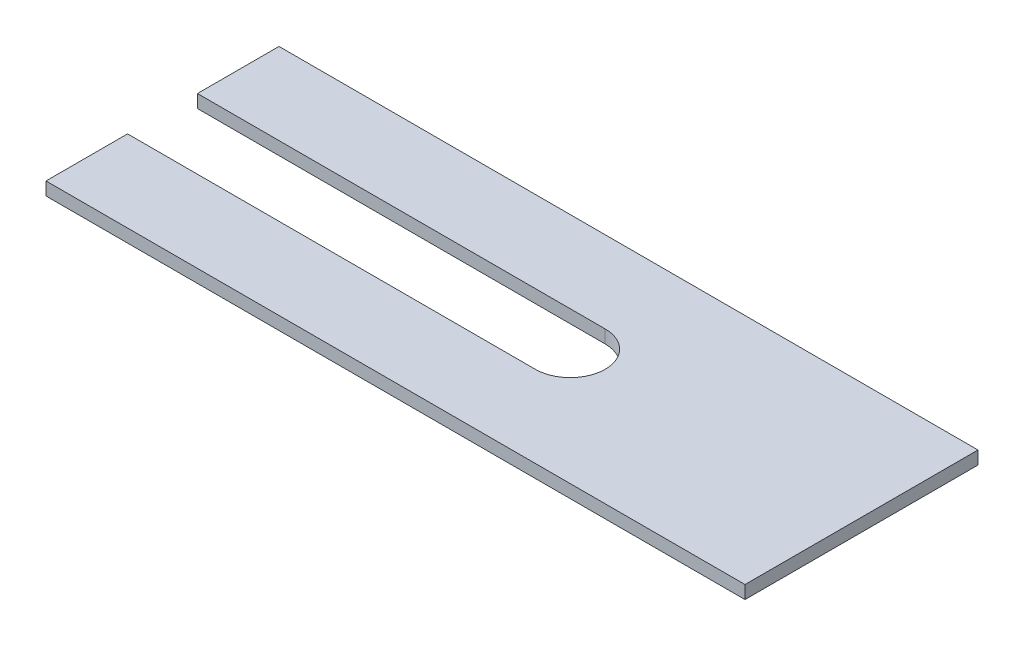
ISO-10303-21;
HEADER;
FILE_DESCRIPTION(('STEP AP214'),'2;1');
FILE_NAME('part.step','',(''),(''),'','','');
FILE_SCHEMA(('AUTOMOTIVE_DESIGN { 1 0 10303 214 1 1 1 1 }'));
ENDSEC;
DATA;
#1=APPLICATION_CONTEXT('core data for automotive mechanical design processes');
#2=APPLICATION_PROTOCOL_DEFINITION('international standard','automotive_design',2000,#1);
#3=PRODUCT_CONTEXT('',#1,'mechanical');
#4=PRODUCT('Part','Part','',(#3));
#5=PRODUCT_RELATED_PRODUCT_CATEGORY('part','',(#4));
#6=PRODUCT_DEFINITION_FORMATION('','',#4);
#7=PRODUCT_DEFINITION_CONTEXT('part definition',#1,'design');
#8=PRODUCT_DEFINITION('design','',#6,#7);
#9=PRODUCT_DEFINITION_SHAPE('','',#8);
#10=(LENGTH_UNIT() NAMED_UNIT(*) SI_UNIT(.MILLI.,.METRE.));
#11=(NAMED_UNIT(*) PLANE_ANGLE_UNIT() SI_UNIT($,.RADIAN.));
#12=(NAMED_UNIT(*) SI_UNIT($,.STERADIAN.) SOLID_ANGLE_UNIT());
#13=UNCERTAINTY_MEASURE_WITH_UNIT(LENGTH_MEASURE(1.E-05),#10,'distance_accuracy_value','');
#14=(GEOMETRIC_REPRESENTATION_CONTEXT(3) GLOBAL_UNCERTAINTY_ASSIGNED_CONTEXT((#13)) GLOBAL_UNIT_ASSIGNED_CONTEXT((#10,
#11,#12)) REPRESENTATION_CONTEXT('',''));
#15=CARTESIAN_POINT('',(0.,0.,0.));
#16=DIRECTION('',(0.,0.,1.));
#17=DIRECTION('',(1.,0.,0.));
#18=AXIS2_PLACEMENT_3D('',#15,#16,#17);
#19=CARTESIAN_POINT('',(17.5,1.62,0.));
#20=DIRECTION('',(0.,-1.,0.));
#21=DIRECTION('',(0.,0.,-1.));
#22=AXIS2_PLACEMENT_3D('',#19,#20,#21);
#23=CYLINDRICAL_SURFACE('',#22,3.);
#24=DIRECTION('',(0.,-1.,0.));
#25=VECTOR('',#24,1.);
#26=CARTESIAN_POINT('',(17.5,1.62,-3.));
#27=LINE('',#26,#25);
#28=CARTESIAN_POINT('',(17.5,1.62,-3.));
#29=VERTEX_POINT('',#28);
#30=CARTESIAN_POINT('',(17.5,0.500000000000007,-3.));
#31=VERTEX_POINT('',#30);
#32=EDGE_CURVE('E171',#29,#31,#27,.T.);
#33=ORIENTED_EDGE('',*,*,#32,.T.);
#34=CARTESIAN_POINT('',(17.5,0.500000000000007,0.));
#35=DIRECTION('',(0.,1.,0.));
#36=DIRECTION('',(0.,0.,1.));
#37=AXIS2_PLACEMENT_3D('',#34,#35,#36);
#38=CIRCLE('',#37,3.);
#39=CARTESIAN_POINT('',(17.5,0.500000000000007,3.));
#40=VERTEX_POINT('',#39);
#41=EDGE_CURVE('E11',#31,#40,#38,.F.);
#42=ORIENTED_EDGE('',*,*,#41,.T.);
#43=DIRECTION('',(0.,-1.,0.));
#44=VECTOR('',#43,1.);
#45=CARTESIAN_POINT('',(17.5,1.62,3.));
#46=LINE('',#45,#44);
#47=CARTESIAN_POINT('',(17.5,1.62,3.));
#48=VERTEX_POINT('',#47);
#49=EDGE_CURVE('E132',#48,#40,#46,.T.);
#50=ORIENTED_EDGE('',*,*,#49,.F.);
#51=CARTESIAN_POINT('',(17.5,1.62,0.));
#52=DIRECTION('',(0.,1.,0.));
#53=DIRECTION('',(0.,0.,1.));
#54=AXIS2_PLACEMENT_3D('',#51,#52,#53);
#55=CIRCLE('',#54,3.);
#56=EDGE_CURVE('E135',#48,#29,#55,.T.);
#57=ORIENTED_EDGE('',*,*,#56,.T.);
#58=EDGE_LOOP('',(#33,#42,#50,#57));
#59=FACE_BOUND('',#58,.T.);
#60=ADVANCED_FACE('F41',(#59),#23,.F.);
#61=CARTESIAN_POINT('',(0.,1.62,3.));
#62=DIRECTION('',(0.,0.,1.));
#63=DIRECTION('',(1.,0.,0.));
#64=AXIS2_PLACEMENT_3D('',#61,#62,#63);
#65=PLANE('',#64);
#66=ORIENTED_EDGE('',*,*,#49,.T.);
#67=DIRECTION('',(-1.,0.,0.));
#68=VECTOR('',#67,1.);
#69=CARTESIAN_POINT('',(0.,0.500000000000007,3.));
#70=LINE('',#69,#68);
#71=CARTESIAN_POINT('',(-17.5,0.500000000000007,3.));
#72=VERTEX_POINT('',#71);
#73=EDGE_CURVE('E141',#40,#72,#70,.T.);
#74=ORIENTED_EDGE('',*,*,#73,.T.);
#75=DIRECTION('',(0.,-1.,0.));
#76=VECTOR('',#75,1.);
#77=CARTESIAN_POINT('',(-17.5,1.62,3.));
#78=LINE('',#77,#76);
#79=CARTESIAN_POINT('',(-17.5,1.62,3.));
#80=VERTEX_POINT('',#79);
#81=EDGE_CURVE('E142',#80,#72,#78,.T.);
#82=ORIENTED_EDGE('',*,*,#81,.F.);
#83=DIRECTION('',(-1.,0.,0.));
#84=VECTOR('',#83,1.);
#85=CARTESIAN_POINT('',(0.,1.62,3.));
#86=LINE('',#85,#84);
#87=EDGE_CURVE('E145',#48,#80,#86,.T.);
#88=ORIENTED_EDGE('',*,*,#87,.F.);
#89=EDGE_LOOP('',(#66,#74,#82,#88));
#90=FACE_BOUND('',#89,.T.);
#91=ADVANCED_FACE('F146',(#90),#65,.F.);
#92=CARTESIAN_POINT('',(-17.5,1.62,0.));
#93=DIRECTION('',(-1.,0.,0.));
#94=DIRECTION('',(0.,0.,1.));
#95=AXIS2_PLACEMENT_3D('',#92,#93,#94);
#96=PLANE('',#95);
#97=ORIENTED_EDGE('',*,*,#81,.T.);
#98=DIRECTION('',(0.,0.,1.));
#99=VECTOR('',#98,1.);
#100=CARTESIAN_POINT('',(-17.5,0.500000000000007,9.99999999999999));
#101=LINE('',#100,#99);
#102=CARTESIAN_POINT('',(-17.5,0.500000000000007,9.99999999999999));
#103=VERTEX_POINT('',#102);
#104=EDGE_CURVE('E205',#72,#103,#101,.T.);
#105=ORIENTED_EDGE('',*,*,#104,.T.);
#106=DIRECTION('',(0.,-1.,0.));
#107=VECTOR('',#106,1.);
#108=CARTESIAN_POINT('',(-17.5,1.62,9.99999999999999));
#109=LINE('',#108,#107);
#110=CARTESIAN_POINT('',(-17.5,1.62,9.99999999999999));
#111=VERTEX_POINT('',#110);
#112=EDGE_CURVE('E183',#111,#103,#109,.T.);
#113=ORIENTED_EDGE('',*,*,#112,.F.);
#114=DIRECTION('',(0.,0.,-1.));
#115=VECTOR('',#114,1.);
#116=CARTESIAN_POINT('',(-17.5,1.62,0.));
#117=LINE('',#116,#115);
#118=EDGE_CURVE('E151',#111,#80,#117,.T.);
#119=ORIENTED_EDGE('',*,*,#118,.T.);
#120=EDGE_LOOP('',(#97,#105,#113,#119));
#121=FACE_BOUND('',#120,.T.);
#122=ADVANCED_FACE('F263',(#121),#96,.T.);
#123=CARTESIAN_POINT('',(0.,1.62,9.99999999999999));
#124=DIRECTION('',(0.,0.,-1.));
#125=DIRECTION('',(-1.,0.,0.));
#126=AXIS2_PLACEMENT_3D('',#123,#124,#125);
#127=PLANE('',#126);
#128=ORIENTED_EDGE('',*,*,#112,.T.);
#129=DIRECTION('',(1.,0.,0.));
#130=VECTOR('',#129,1.);
#131=CARTESIAN_POINT('',(0.,0.500000000000007,9.99999999999999));
#132=LINE('',#131,#130);
#133=CARTESIAN_POINT('',(42.5,0.500000000000007,9.99999999999999));
#134=VERTEX_POINT('',#133);
#135=EDGE_CURVE('E207',#103,#134,#132,.T.);
#136=ORIENTED_EDGE('',*,*,#135,.T.);
#137=DIRECTION('',(0.,-1.,0.));
#138=VECTOR('',#137,1.);
#139=CARTESIAN_POINT('',(42.5,1.62,9.99999999999999));
#140=LINE('',#139,#138);
#141=CARTESIAN_POINT('',(42.5,1.62,9.99999999999999));
#142=VERTEX_POINT('',#141);
#143=EDGE_CURVE('E180',#142,#134,#140,.T.);
#144=ORIENTED_EDGE('',*,*,#143,.F.);
#145=DIRECTION('',(1.,0.,0.));
#146=VECTOR('',#145,1.);
#147=CARTESIAN_POINT('',(0.,1.62,9.99999999999999));
#148=LINE('',#147,#146);
#149=EDGE_CURVE('E162',#111,#142,#148,.T.);
#150=ORIENTED_EDGE('',*,*,#149,.F.);
#151=EDGE_LOOP('',(#128,#136,#144,#150));
#152=FACE_BOUND('',#151,.T.);
#153=ADVANCED_FACE('F268',(#152),#127,.F.);
#154=CARTESIAN_POINT('',(42.5,1.62,0.));
#155=DIRECTION('',(-1.,0.,0.));
#156=DIRECTION('',(0.,0.,1.));
#157=AXIS2_PLACEMENT_3D('',#154,#155,#156);
#158=PLANE('',#157);
#159=ORIENTED_EDGE('',*,*,#143,.T.);
#160=DIRECTION('',(0.,0.,-1.));
#161=VECTOR('',#160,1.);
#162=CARTESIAN_POINT('',(42.5,0.500000000000007,0.));
#163=LINE('',#162,#161);
#164=CARTESIAN_POINT('',(42.5,0.500000000000007,-10.));
#165=VERTEX_POINT('',#164);
#166=EDGE_CURVE('E209',#134,#165,#163,.T.);
#167=ORIENTED_EDGE('',*,*,#166,.T.);
#168=DIRECTION('',(0.,-1.,0.));
#169=VECTOR('',#168,1.);
#170=CARTESIAN_POINT('',(42.5,1.62,-10.));
#171=LINE('',#170,#169);
#172=CARTESIAN_POINT('',(42.5,1.62,-10.));
#173=VERTEX_POINT('',#172);
#174=EDGE_CURVE('E177',#173,#165,#171,.T.);
#175=ORIENTED_EDGE('',*,*,#174,.F.);
#176=DIRECTION('',(0.,0.,-1.));
#177=VECTOR('',#176,1.);
#178=CARTESIAN_POINT('',(42.5,1.62,0.));
#179=LINE('',#178,#177);
#180=EDGE_CURVE('E165',#142,#173,#179,.T.);
#181=ORIENTED_EDGE('',*,*,#180,.F.);
#182=EDGE_LOOP('',(#159,#167,#175,#181));
#183=FACE_BOUND('',#182,.T.);
#184=ADVANCED_FACE('F271',(#183),#158,.F.);
#185=CARTESIAN_POINT('',(0.,1.62,-10.));
#186=DIRECTION('',(0.,0.,-1.));
#187=DIRECTION('',(-1.,0.,0.));
#188=AXIS2_PLACEMENT_3D('',#185,#186,#187);
#189=PLANE('',#188);
#190=ORIENTED_EDGE('',*,*,#174,.T.);
#191=DIRECTION('',(-1.,0.,0.));
#192=VECTOR('',#191,1.);
#193=CARTESIAN_POINT('',(-17.5,0.500000000000007,-10.));
#194=LINE('',#193,#192);
#195=CARTESIAN_POINT('',(-17.5,0.500000000000007,-10.));
#196=VERTEX_POINT('',#195);
#197=EDGE_CURVE('E211',#165,#196,#194,.T.);
#198=ORIENTED_EDGE('',*,*,#197,.T.);
#199=DIRECTION('',(0.,-1.,0.));
#200=VECTOR('',#199,1.);
#201=CARTESIAN_POINT('',(-17.5,1.62,-10.));
#202=LINE('',#201,#200);
#203=CARTESIAN_POINT('',(-17.5,1.62,-10.));
#204=VERTEX_POINT('',#203);
#205=EDGE_CURVE('E175',#204,#196,#202,.T.);
#206=ORIENTED_EDGE('',*,*,#205,.F.);
#207=DIRECTION('',(1.,0.,0.));
#208=VECTOR('',#207,1.);
#209=CARTESIAN_POINT('',(0.,1.62,-10.));
#210=LINE('',#209,#208);
#211=EDGE_CURVE('E167',#204,#173,#210,.T.);
#212=ORIENTED_EDGE('',*,*,#211,.T.);
#213=EDGE_LOOP('',(#190,#198,#206,#212));
#214=FACE_BOUND('',#213,.T.);
#215=ADVANCED_FACE('F242',(#214),#189,.T.);
#216=ORIENTED_EDGE('',*,*,#205,.T.);
#217=DIRECTION('',(0.,0.,1.));
#218=VECTOR('',#217,1.);
#219=CARTESIAN_POINT('',(-17.5,0.500000000000007,-3.));
#220=LINE('',#219,#218);
#221=CARTESIAN_POINT('',(-17.5,0.500000000000007,-3.));
#222=VERTEX_POINT('',#221);
#223=EDGE_CURVE('E66',#196,#222,#220,.T.);
#224=ORIENTED_EDGE('',*,*,#223,.T.);
#225=DIRECTION('',(0.,-1.,0.));
#226=VECTOR('',#225,1.);
#227=CARTESIAN_POINT('',(-17.5,1.62,-3.));
#228=LINE('',#227,#226);
#229=CARTESIAN_POINT('',(-17.5,1.62,-3.));
#230=VERTEX_POINT('',#229);
#231=EDGE_CURVE('E173',#230,#222,#228,.T.);
#232=ORIENTED_EDGE('',*,*,#231,.F.);
#233=EDGE_CURVE('E163',#230,#204,#117,.T.);
#234=ORIENTED_EDGE('',*,*,#233,.T.);
#235=EDGE_LOOP('',(#216,#224,#232,#234));
#236=FACE_BOUND('',#235,.T.);
#237=ADVANCED_FACE('F246',(#236),#96,.T.);
#238=CARTESIAN_POINT('',(0.,1.62,-3.));
#239=DIRECTION('',(0.,0.,1.));
#240=DIRECTION('',(1.,0.,0.));
#241=AXIS2_PLACEMENT_3D('',#238,#239,#240);
#242=PLANE('',#241);
#243=ORIENTED_EDGE('',*,*,#231,.T.);
#244=DIRECTION('',(1.,0.,0.));
#245=VECTOR('',#244,1.);
#246=CARTESIAN_POINT('',(17.5,0.500000000000007,-3.));
#247=LINE('',#246,#245);
#248=EDGE_CURVE('E51',#222,#31,#247,.T.);
#249=ORIENTED_EDGE('',*,*,#248,.T.);
#250=ORIENTED_EDGE('',*,*,#32,.F.);
#251=DIRECTION('',(-1.,0.,0.));
#252=VECTOR('',#251,1.);
#253=CARTESIAN_POINT('',(0.,1.62,-3.));
#254=LINE('',#253,#252);
#255=EDGE_CURVE('E156',#29,#230,#254,.T.);
#256=ORIENTED_EDGE('',*,*,#255,.T.);
#257=EDGE_LOOP('',(#243,#249,#250,#256));
#258=FACE_BOUND('',#257,.T.);
#259=ADVANCED_FACE('F247',(#258),#242,.T.);
#260=CARTESIAN_POINT('',(0.,1.62,0.));
#261=DIRECTION('',(0.,1.,0.));
#262=DIRECTION('',(0.,0.,1.));
#263=AXIS2_PLACEMENT_3D('',#260,#261,#262);
#264=PLANE('',#263);
#265=ORIENTED_EDGE('',*,*,#56,.F.);
#266=ORIENTED_EDGE('',*,*,#87,.T.);
#267=ORIENTED_EDGE('',*,*,#118,.F.);
#268=ORIENTED_EDGE('',*,*,#149,.T.);
#269=ORIENTED_EDGE('',*,*,#180,.T.);
#270=ORIENTED_EDGE('',*,*,#211,.F.);
#271=ORIENTED_EDGE('',*,*,#233,.F.);
#272=ORIENTED_EDGE('',*,*,#255,.F.);
#273=EDGE_LOOP('',(#265,#266,#267,#268,#269,#270,#271,#272));
#274=FACE_BOUND('',#273,.T.);
#275=ADVANCED_FACE('F153',(#274),#264,.T.);
#276=CARTESIAN_POINT('',(0.,0.,0.));
#277=DIRECTION('',(0.,1.,0.));
#278=DIRECTION('',(0.,0.,1.));
#279=AXIS2_PLACEMENT_3D('',#276,#277,#278);
#280=PLANE('',#279);
#281=DIRECTION('',(0.,0.,-1.));
#282=VECTOR('',#281,1.);
#283=CARTESIAN_POINT('',(-17.,0.,3.));
#284=LINE('',#283,#282);
#285=CARTESIAN_POINT('',(-17.,0.,9.5));
#286=VERTEX_POINT('',#285);
#287=CARTESIAN_POINT('',(-17.,0.,3.5));
#288=VERTEX_POINT('',#287);
#289=EDGE_CURVE('E200',#286,#288,#284,.T.);
#290=ORIENTED_EDGE('',*,*,#289,.T.);
#291=DIRECTION('',(1.,0.,0.));
#292=VECTOR('',#291,1.);
#293=CARTESIAN_POINT('',(0.,0.,3.5));
#294=LINE('',#293,#292);
#295=CARTESIAN_POINT('',(17.5,0.,3.49999999999999));
#296=VERTEX_POINT('',#295);
#297=EDGE_CURVE('E202',#288,#296,#294,.T.);
#298=ORIENTED_EDGE('',*,*,#297,.T.);
#299=CARTESIAN_POINT('',(17.5,0.,0.));
#300=DIRECTION('',(0.,1.,0.));
#301=DIRECTION('',(0.,0.,1.));
#302=AXIS2_PLACEMENT_3D('',#299,#300,#301);
#303=CIRCLE('',#302,3.5);
#304=CARTESIAN_POINT('',(17.5,0.,-3.50000000000001));
#305=VERTEX_POINT('',#304);
#306=EDGE_CURVE('E188',#296,#305,#303,.T.);
#307=ORIENTED_EDGE('',*,*,#306,.T.);
#308=DIRECTION('',(-1.,0.,0.));
#309=VECTOR('',#308,1.);
#310=CARTESIAN_POINT('',(-17.5,0.,-3.49999999999999));
#311=LINE('',#310,#309);
#312=CARTESIAN_POINT('',(-17.,0.,-3.49999999999999));
#313=VERTEX_POINT('',#312);
#314=EDGE_CURVE('E190',#305,#313,#311,.T.);
#315=ORIENTED_EDGE('',*,*,#314,.T.);
#316=DIRECTION('',(0.,0.,-1.));
#317=VECTOR('',#316,1.);
#318=CARTESIAN_POINT('',(-17.,0.,-10.));
#319=LINE('',#318,#317);
#320=CARTESIAN_POINT('',(-17.,0.,-9.50000000000001));
#321=VERTEX_POINT('',#320);
#322=EDGE_CURVE('E192',#313,#321,#319,.T.);
#323=ORIENTED_EDGE('',*,*,#322,.T.);
#324=DIRECTION('',(1.,0.,0.));
#325=VECTOR('',#324,1.);
#326=CARTESIAN_POINT('',(42.5,0.,-9.50000000000001));
#327=LINE('',#326,#325);
#328=CARTESIAN_POINT('',(42.,0.,-9.50000000000001));
#329=VERTEX_POINT('',#328);
#330=EDGE_CURVE('E194',#321,#329,#327,.T.);
#331=ORIENTED_EDGE('',*,*,#330,.T.);
#332=DIRECTION('',(0.,0.,1.));
#333=VECTOR('',#332,1.);
#334=CARTESIAN_POINT('',(42.,0.,0.));
#335=LINE('',#334,#333);
#336=CARTESIAN_POINT('',(42.,0.,9.5));
#337=VERTEX_POINT('',#336);
#338=EDGE_CURVE('E196',#329,#337,#335,.T.);
#339=ORIENTED_EDGE('',*,*,#338,.T.);
#340=DIRECTION('',(-1.,0.,0.));
#341=VECTOR('',#340,1.);
#342=CARTESIAN_POINT('',(0.,0.,9.5));
#343=LINE('',#342,#341);
#344=EDGE_CURVE('E198',#337,#286,#343,.T.);
#345=ORIENTED_EDGE('',*,*,#344,.T.);
#346=EDGE_LOOP('',(#290,#298,#307,#315,#323,#331,#339,#345));
#347=FACE_BOUND('',#346,.T.);
#348=ADVANCED_FACE('F330',(#347),#280,.F.);
#349=CARTESIAN_POINT('',(0.,0.,-9.50000000000001));
#350=DIRECTION('',(0.,-0.70710678118654,-0.707106781186555));
#351=DIRECTION('',(-1.,0.,0.));
#352=AXIS2_PLACEMENT_3D('',#349,#350,#351);
#353=PLANE('',#352);
#354=DIRECTION('',(0.577350269189625,0.577350269189632,-0.577350269189621));
#355=VECTOR('',#354,1.);
#356=CARTESIAN_POINT('',(28.0000000000001,-14.0000000000001,4.49999999999984));
#357=LINE('',#356,#355);
#358=EDGE_CURVE('E159',#329,#165,#357,.T.);
#359=ORIENTED_EDGE('',*,*,#358,.F.);
#360=ORIENTED_EDGE('',*,*,#330,.F.);
#361=DIRECTION('',(0.577350269189622,-0.577350269189634,0.577350269189622));
#362=VECTOR('',#361,1.);
#363=CARTESIAN_POINT('',(-13.8333333333334,-3.16666666666669,-6.33333333333338));
#364=LINE('',#363,#362);
#365=EDGE_CURVE('E46',#196,#321,#364,.T.);
#366=ORIENTED_EDGE('',*,*,#365,.F.);
#367=ORIENTED_EDGE('',*,*,#197,.F.);
#368=EDGE_LOOP('',(#359,#360,#366,#367));
#369=FACE_BOUND('',#368,.T.);
#370=ADVANCED_FACE('F44',(#369),#353,.T.);
#371=CARTESIAN_POINT('',(-17.,0.,0.));
#372=DIRECTION('',(-0.707106781186555,-0.70710678118654,0.));
#373=DIRECTION('',(0.,0.,1.));
#374=AXIS2_PLACEMENT_3D('',#371,#372,#373);
#375=PLANE('',#374);
#376=ORIENTED_EDGE('',*,*,#365,.T.);
#377=ORIENTED_EDGE('',*,*,#322,.F.);
#378=DIRECTION('',(0.577350269189622,-0.577350269189633,-0.577350269189622));
#379=VECTOR('',#378,1.);
#380=CARTESIAN_POINT('',(-11.3333333333334,-5.66666666666671,-9.16666666666659));
#381=LINE('',#380,#379);
#382=EDGE_CURVE('E228',#222,#313,#381,.T.);
#383=ORIENTED_EDGE('',*,*,#382,.F.);
#384=ORIENTED_EDGE('',*,*,#223,.F.);
#385=EDGE_LOOP('',(#376,#377,#383,#384));
#386=FACE_BOUND('',#385,.T.);
#387=ADVANCED_FACE('F322',(#386),#375,.T.);
#388=CARTESIAN_POINT('',(42.5,0.500000000000007,0.));
#389=DIRECTION('',(-0.707106781186552,0.707106781186543,0.));
#390=DIRECTION('',(0.,0.,-1.));
#391=AXIS2_PLACEMENT_3D('',#388,#389,#390);
#392=PLANE('',#391);
#393=ORIENTED_EDGE('',*,*,#358,.T.);
#394=ORIENTED_EDGE('',*,*,#166,.F.);
#395=DIRECTION('',(-0.577350269189625,-0.577350269189632,-0.577350269189621));
#396=VECTOR('',#395,1.);
#397=CARTESIAN_POINT('',(39.1666666666667,-2.83333333333333,6.66666666666672));
#398=LINE('',#397,#396);
#399=EDGE_CURVE('E225',#337,#134,#398,.F.);
#400=ORIENTED_EDGE('',*,*,#399,.F.);
#401=ORIENTED_EDGE('',*,*,#338,.F.);
#402=EDGE_LOOP('',(#393,#394,#400,#401));
#403=FACE_BOUND('',#402,.T.);
#404=ADVANCED_FACE('F235',(#403),#392,.F.);
#405=CARTESIAN_POINT('',(0.,0.,-3.5));
#406=DIRECTION('',(0.,-0.70710678118654,0.707106781186555));
#407=DIRECTION('',(1.,0.,0.));
#408=AXIS2_PLACEMENT_3D('',#405,#406,#407);
#409=PLANE('',#408);
#410=ORIENTED_EDGE('',*,*,#382,.T.);
#411=ORIENTED_EDGE('',*,*,#314,.F.);
#412=DIRECTION('',(0.,-0.707106781186555,-0.70710678118654));
#413=VECTOR('',#412,1.);
#414=CARTESIAN_POINT('',(17.5,0.500000000000007,-3.));
#415=LINE('',#414,#413);
#416=EDGE_CURVE('E222',#31,#305,#415,.T.);
#417=ORIENTED_EDGE('',*,*,#416,.F.);
#418=ORIENTED_EDGE('',*,*,#248,.F.);
#419=EDGE_LOOP('',(#410,#411,#417,#418));
#420=FACE_BOUND('',#419,.T.);
#421=ADVANCED_FACE('F252',(#420),#409,.T.);
#422=CARTESIAN_POINT('',(0.,0.500000000000007,9.99999999999999));
#423=DIRECTION('',(0.,0.70710678118654,-0.707106781186555));
#424=DIRECTION('',(1.,0.,0.));
#425=AXIS2_PLACEMENT_3D('',#422,#423,#424);
#426=PLANE('',#425);
#427=ORIENTED_EDGE('',*,*,#399,.T.);
#428=ORIENTED_EDGE('',*,*,#135,.F.);
#429=DIRECTION('',(-0.577350269189622,0.577350269189634,0.577350269189622));
#430=VECTOR('',#429,1.);
#431=CARTESIAN_POINT('',(-11.6666666666667,-5.33333333333337,4.16666666666674));
#432=LINE('',#431,#430);
#433=EDGE_CURVE('E219',#286,#103,#432,.T.);
#434=ORIENTED_EDGE('',*,*,#433,.F.);
#435=ORIENTED_EDGE('',*,*,#344,.F.);
#436=EDGE_LOOP('',(#427,#428,#434,#435));
#437=FACE_BOUND('',#436,.T.);
#438=ADVANCED_FACE('F306',(#437),#426,.F.);
#439=CARTESIAN_POINT('',(17.5,0.,0.));
#440=DIRECTION('',(0.,-1.,0.));
#441=DIRECTION('',(0.,0.,-1.));
#442=AXIS2_PLACEMENT_3D('',#439,#440,#441);
#443=CONICAL_SURFACE('',#442,3.5,0.785398163397438);
#444=ORIENTED_EDGE('',*,*,#416,.T.);
#445=ORIENTED_EDGE('',*,*,#306,.F.);
#446=DIRECTION('',(0.,-0.707106781186555,0.70710678118654));
#447=VECTOR('',#446,1.);
#448=CARTESIAN_POINT('',(17.5,0.500000000000007,2.99999999999999));
#449=LINE('',#448,#447);
#450=EDGE_CURVE('E217',#40,#296,#449,.T.);
#451=ORIENTED_EDGE('',*,*,#450,.F.);
#452=ORIENTED_EDGE('',*,*,#41,.F.);
#453=EDGE_LOOP('',(#444,#445,#451,#452));
#454=FACE_BOUND('',#453,.T.);
#455=ADVANCED_FACE('F255',(#454),#443,.F.);
#456=CARTESIAN_POINT('',(-17.,0.,0.));
#457=DIRECTION('',(-0.707106781186555,-0.70710678118654,0.));
#458=DIRECTION('',(0.,0.,1.));
#459=AXIS2_PLACEMENT_3D('',#456,#457,#458);
#460=PLANE('',#459);
#461=ORIENTED_EDGE('',*,*,#433,.T.);
#462=ORIENTED_EDGE('',*,*,#104,.F.);
#463=DIRECTION('',(-0.577350269189622,0.577350269189634,-0.577350269189622));
#464=VECTOR('',#463,1.);
#465=CARTESIAN_POINT('',(-18.1666666666667,1.16666666666667,2.33333333333335));
#466=LINE('',#465,#464);
#467=EDGE_CURVE('E215',#288,#72,#466,.T.);
#468=ORIENTED_EDGE('',*,*,#467,.F.);
#469=ORIENTED_EDGE('',*,*,#289,.F.);
#470=EDGE_LOOP('',(#461,#462,#468,#469));
#471=FACE_BOUND('',#470,.T.);
#472=ADVANCED_FACE('F294',(#471),#460,.T.);
#473=CARTESIAN_POINT('',(0.,0.500000000000007,3.));
#474=DIRECTION('',(0.,0.70710678118654,0.707106781186555));
#475=DIRECTION('',(-1.,0.,0.));
#476=AXIS2_PLACEMENT_3D('',#473,#474,#475);
#477=PLANE('',#476);
#478=ORIENTED_EDGE('',*,*,#450,.T.);
#479=ORIENTED_EDGE('',*,*,#297,.F.);
#480=ORIENTED_EDGE('',*,*,#467,.T.);
#481=ORIENTED_EDGE('',*,*,#73,.F.);
#482=EDGE_LOOP('',(#478,#479,#480,#481));
#483=FACE_BOUND('',#482,.T.);
#484=ADVANCED_FACE('F259',(#483),#477,.F.);
#485=CLOSED_SHELL('',(#60,#91,#122,#153,#184,#215,#237,#259,#275,#348,#370,#387,#404,#421,#438,
#455,#472,#484));
#486=MANIFOLD_SOLID_BREP('B2',#485);
#487=ADVANCED_BREP_SHAPE_REPRESENTATION('',(#18,#486),#14);
#488=SHAPE_DEFINITION_REPRESENTATION(#9,#487);
ENDSEC;
END-ISO-10303-21;
